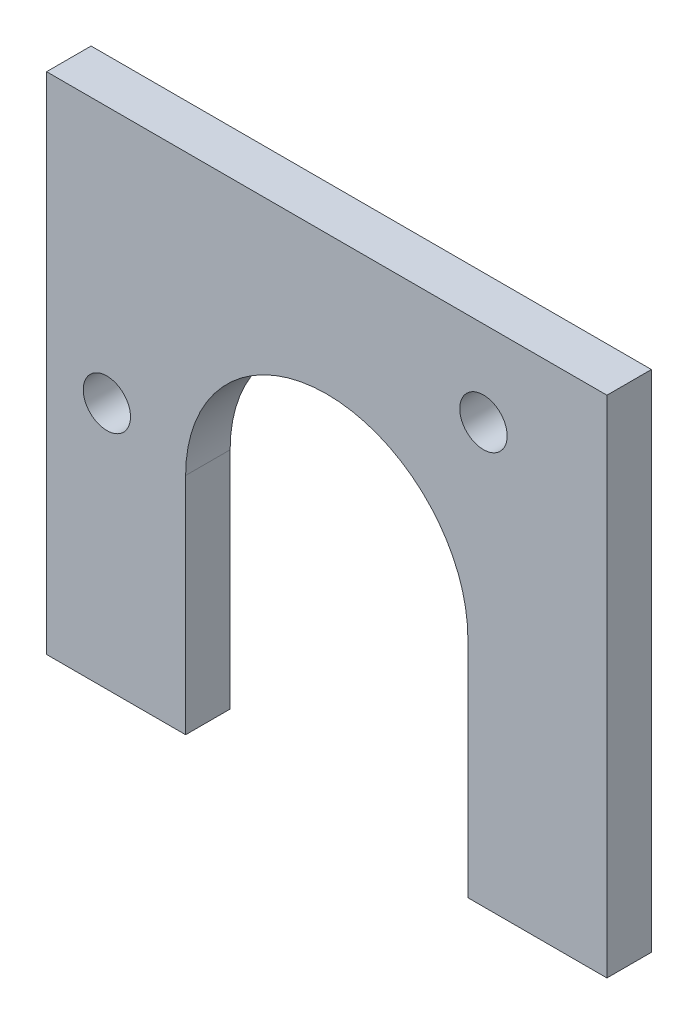
ISO-10303-21;
HEADER;
FILE_DESCRIPTION(('STEP AP214'),'2;1');
FILE_NAME('part.step','',(''),(''),'','','');
FILE_SCHEMA(('AUTOMOTIVE_DESIGN { 1 0 10303 214 1 1 1 1 }'));
ENDSEC;
DATA;
#1=APPLICATION_CONTEXT('core data for automotive mechanical design processes');
#2=APPLICATION_PROTOCOL_DEFINITION('international standard','automotive_design',2000,#1);
#3=PRODUCT_CONTEXT('',#1,'mechanical');
#4=PRODUCT('Part','Part','',(#3));
#5=PRODUCT_RELATED_PRODUCT_CATEGORY('part','',(#4));
#6=PRODUCT_DEFINITION_FORMATION('','',#4);
#7=PRODUCT_DEFINITION_CONTEXT('part definition',#1,'design');
#8=PRODUCT_DEFINITION('design','',#6,#7);
#9=PRODUCT_DEFINITION_SHAPE('','',#8);
#10=(LENGTH_UNIT() NAMED_UNIT(*) SI_UNIT(.MILLI.,.METRE.));
#11=(NAMED_UNIT(*) PLANE_ANGLE_UNIT() SI_UNIT($,.RADIAN.));
#12=(NAMED_UNIT(*) SI_UNIT($,.STERADIAN.) SOLID_ANGLE_UNIT());
#13=UNCERTAINTY_MEASURE_WITH_UNIT(LENGTH_MEASURE(1.E-05),#10,'distance_accuracy_value','');
#14=(GEOMETRIC_REPRESENTATION_CONTEXT(3) GLOBAL_UNCERTAINTY_ASSIGNED_CONTEXT((#13)) GLOBAL_UNIT_ASSIGNED_CONTEXT((#10,
#11,#12)) REPRESENTATION_CONTEXT('',''));
#15=CARTESIAN_POINT('',(0.,0.,0.));
#16=DIRECTION('',(0.,0.,1.));
#17=DIRECTION('',(1.,0.,0.));
#18=AXIS2_PLACEMENT_3D('',#15,#16,#17);
#19=CARTESIAN_POINT('',(10.075,5.,1.6));
#20=DIRECTION('',(1.,0.,0.));
#21=DIRECTION('',(0.,1.,0.));
#22=AXIS2_PLACEMENT_3D('',#19,#20,#21);
#23=PLANE('',#22);
#24=DIRECTION('',(0.,-1.,0.));
#25=VECTOR('',#24,1.);
#26=CARTESIAN_POINT('',(10.075,5.,0.));
#27=LINE('',#26,#25);
#28=CARTESIAN_POINT('',(10.075,5.,0.));
#29=VERTEX_POINT('',#28);
#30=CARTESIAN_POINT('',(10.075,-13.15,0.));
#31=VERTEX_POINT('',#30);
#32=EDGE_CURVE('E134',#29,#31,#27,.T.);
#33=ORIENTED_EDGE('',*,*,#32,.F.);
#34=DIRECTION('',(0.,0.,-1.));
#35=VECTOR('',#34,1.);
#36=CARTESIAN_POINT('',(10.075,5.,1.6));
#37=LINE('',#36,#35);
#38=CARTESIAN_POINT('',(10.075,5.,1.6));
#39=VERTEX_POINT('',#38);
#40=EDGE_CURVE('E11',#39,#29,#37,.T.);
#41=ORIENTED_EDGE('',*,*,#40,.F.);
#42=DIRECTION('',(0.,-1.,0.));
#43=VECTOR('',#42,1.);
#44=CARTESIAN_POINT('',(10.075,5.,1.6));
#45=LINE('',#44,#43);
#46=CARTESIAN_POINT('',(10.075,-13.15,1.6));
#47=VERTEX_POINT('',#46);
#48=EDGE_CURVE('E152',#39,#47,#45,.T.);
#49=ORIENTED_EDGE('',*,*,#48,.T.);
#50=DIRECTION('',(0.,0.,-1.));
#51=VECTOR('',#50,1.);
#52=CARTESIAN_POINT('',(10.075,-13.15,1.6));
#53=LINE('',#52,#51);
#54=EDGE_CURVE('E89',#47,#31,#53,.T.);
#55=ORIENTED_EDGE('',*,*,#54,.T.);
#56=EDGE_LOOP('',(#33,#41,#49,#55));
#57=FACE_BOUND('',#56,.T.);
#58=ADVANCED_FACE('F35',(#57),#23,.T.);
#59=CARTESIAN_POINT('',(10.075,5.,1.6));
#60=DIRECTION('',(0.,-1.,0.));
#61=DIRECTION('',(0.,0.,-1.));
#62=AXIS2_PLACEMENT_3D('',#59,#60,#61);
#63=PLANE('',#62);
#64=DIRECTION('',(-1.,0.,0.));
#65=VECTOR('',#64,1.);
#66=CARTESIAN_POINT('',(10.075,5.,0.));
#67=LINE('',#66,#65);
#68=CARTESIAN_POINT('',(-10.075,5.,0.));
#69=VERTEX_POINT('',#68);
#70=EDGE_CURVE('E80',#29,#69,#67,.T.);
#71=ORIENTED_EDGE('',*,*,#70,.T.);
#72=DIRECTION('',(0.,0.,-1.));
#73=VECTOR('',#72,1.);
#74=CARTESIAN_POINT('',(-10.075,5.,1.6));
#75=LINE('',#74,#73);
#76=CARTESIAN_POINT('',(-10.075,5.,1.6));
#77=VERTEX_POINT('',#76);
#78=EDGE_CURVE('E44',#77,#69,#75,.T.);
#79=ORIENTED_EDGE('',*,*,#78,.F.);
#80=DIRECTION('',(-1.,0.,0.));
#81=VECTOR('',#80,1.);
#82=CARTESIAN_POINT('',(10.075,5.,1.6));
#83=LINE('',#82,#81);
#84=EDGE_CURVE('E112',#39,#77,#83,.T.);
#85=ORIENTED_EDGE('',*,*,#84,.F.);
#86=ORIENTED_EDGE('',*,*,#40,.T.);
#87=EDGE_LOOP('',(#71,#79,#85,#86));
#88=FACE_BOUND('',#87,.T.);
#89=ADVANCED_FACE('F205',(#88),#63,.F.);
#90=CARTESIAN_POINT('',(-10.075,5.,1.6));
#91=DIRECTION('',(1.,0.,0.));
#92=DIRECTION('',(0.,1.,0.));
#93=AXIS2_PLACEMENT_3D('',#90,#91,#92);
#94=PLANE('',#93);
#95=DIRECTION('',(0.,-1.,0.));
#96=VECTOR('',#95,1.);
#97=CARTESIAN_POINT('',(-10.075,5.,0.));
#98=LINE('',#97,#96);
#99=CARTESIAN_POINT('',(-10.075,-13.15,0.));
#100=VERTEX_POINT('',#99);
#101=EDGE_CURVE('E119',#69,#100,#98,.T.);
#102=ORIENTED_EDGE('',*,*,#101,.T.);
#103=DIRECTION('',(0.,0.,-1.));
#104=VECTOR('',#103,1.);
#105=CARTESIAN_POINT('',(-10.075,-13.15,1.6));
#106=LINE('',#105,#104);
#107=CARTESIAN_POINT('',(-10.075,-13.15,1.6));
#108=VERTEX_POINT('',#107);
#109=EDGE_CURVE('E116',#108,#100,#106,.T.);
#110=ORIENTED_EDGE('',*,*,#109,.F.);
#111=DIRECTION('',(0.,-1.,0.));
#112=VECTOR('',#111,1.);
#113=CARTESIAN_POINT('',(-10.075,5.,1.6));
#114=LINE('',#113,#112);
#115=EDGE_CURVE('E105',#77,#108,#114,.T.);
#116=ORIENTED_EDGE('',*,*,#115,.F.);
#117=ORIENTED_EDGE('',*,*,#78,.T.);
#118=EDGE_LOOP('',(#102,#110,#116,#117));
#119=FACE_BOUND('',#118,.T.);
#120=ADVANCED_FACE('F117',(#119),#94,.F.);
#121=CARTESIAN_POINT('',(-10.075,-13.15,1.6));
#122=DIRECTION('',(0.,1.,0.));
#123=DIRECTION('',(0.,0.,1.));
#124=AXIS2_PLACEMENT_3D('',#121,#122,#123);
#125=PLANE('',#124);
#126=DIRECTION('',(1.,0.,0.));
#127=VECTOR('',#126,1.);
#128=CARTESIAN_POINT('',(-10.075,-13.15,0.));
#129=LINE('',#128,#127);
#130=CARTESIAN_POINT('',(-5.075,-13.15,0.));
#131=VERTEX_POINT('',#130);
#132=EDGE_CURVE('E149',#100,#131,#129,.T.);
#133=ORIENTED_EDGE('',*,*,#132,.T.);
#134=DIRECTION('',(0.,0.,-1.));
#135=VECTOR('',#134,1.);
#136=CARTESIAN_POINT('',(-5.075,-13.15,1.6));
#137=LINE('',#136,#135);
#138=CARTESIAN_POINT('',(-5.075,-13.15,1.6));
#139=VERTEX_POINT('',#138);
#140=EDGE_CURVE('E122',#139,#131,#137,.T.);
#141=ORIENTED_EDGE('',*,*,#140,.F.);
#142=DIRECTION('',(1.,0.,0.));
#143=VECTOR('',#142,1.);
#144=CARTESIAN_POINT('',(-10.075,-13.15,1.6));
#145=LINE('',#144,#143);
#146=EDGE_CURVE('E110',#108,#139,#145,.T.);
#147=ORIENTED_EDGE('',*,*,#146,.F.);
#148=ORIENTED_EDGE('',*,*,#109,.T.);
#149=EDGE_LOOP('',(#133,#141,#147,#148));
#150=FACE_BOUND('',#149,.T.);
#151=ADVANCED_FACE('F124',(#150),#125,.F.);
#152=CARTESIAN_POINT('',(-5.075,-13.15,1.6));
#153=DIRECTION('',(-1.,0.,0.));
#154=DIRECTION('',(0.,0.,1.));
#155=AXIS2_PLACEMENT_3D('',#152,#153,#154);
#156=PLANE('',#155);
#157=DIRECTION('',(0.,1.,0.));
#158=VECTOR('',#157,1.);
#159=CARTESIAN_POINT('',(-5.075,-13.15,0.));
#160=LINE('',#159,#158);
#161=CARTESIAN_POINT('',(-5.075,-5.075,0.));
#162=VERTEX_POINT('',#161);
#163=EDGE_CURVE('E147',#131,#162,#160,.T.);
#164=ORIENTED_EDGE('',*,*,#163,.T.);
#165=DIRECTION('',(0.,0.,-1.));
#166=VECTOR('',#165,1.);
#167=CARTESIAN_POINT('',(-5.075,-5.075,1.6));
#168=LINE('',#167,#166);
#169=CARTESIAN_POINT('',(-5.075,-5.075,1.6));
#170=VERTEX_POINT('',#169);
#171=EDGE_CURVE('E156',#170,#162,#168,.T.);
#172=ORIENTED_EDGE('',*,*,#171,.F.);
#173=DIRECTION('',(0.,1.,0.));
#174=VECTOR('',#173,1.);
#175=CARTESIAN_POINT('',(-5.075,-13.15,1.6));
#176=LINE('',#175,#174);
#177=EDGE_CURVE('E127',#139,#170,#176,.T.);
#178=ORIENTED_EDGE('',*,*,#177,.F.);
#179=ORIENTED_EDGE('',*,*,#140,.T.);
#180=EDGE_LOOP('',(#164,#172,#178,#179));
#181=FACE_BOUND('',#180,.T.);
#182=ADVANCED_FACE('F195',(#181),#156,.F.);
#183=CARTESIAN_POINT('',(0.,-5.075,1.6));
#184=DIRECTION('',(0.,0.,-1.));
#185=DIRECTION('',(-1.,0.,0.));
#186=AXIS2_PLACEMENT_3D('',#183,#184,#185);
#187=CYLINDRICAL_SURFACE('',#186,5.075);
#188=CARTESIAN_POINT('',(0.,-5.075,0.));
#189=DIRECTION('',(0.,0.,-1.));
#190=DIRECTION('',(-1.,0.,0.));
#191=AXIS2_PLACEMENT_3D('',#188,#189,#190);
#192=CIRCLE('',#191,5.075);
#193=CARTESIAN_POINT('',(5.075,-5.075,0.));
#194=VERTEX_POINT('',#193);
#195=EDGE_CURVE('E144',#162,#194,#192,.T.);
#196=ORIENTED_EDGE('',*,*,#195,.T.);
#197=DIRECTION('',(0.,0.,-1.));
#198=VECTOR('',#197,1.);
#199=CARTESIAN_POINT('',(5.075,-5.075,1.6));
#200=LINE('',#199,#198);
#201=CARTESIAN_POINT('',(5.075,-5.075,1.6));
#202=VERTEX_POINT('',#201);
#203=EDGE_CURVE('E159',#202,#194,#200,.T.);
#204=ORIENTED_EDGE('',*,*,#203,.F.);
#205=CARTESIAN_POINT('',(0.,-5.075,1.6));
#206=DIRECTION('',(0.,0.,-1.));
#207=DIRECTION('',(-1.,0.,0.));
#208=AXIS2_PLACEMENT_3D('',#205,#206,#207);
#209=CIRCLE('',#208,5.075);
#210=EDGE_CURVE('E129',#170,#202,#209,.T.);
#211=ORIENTED_EDGE('',*,*,#210,.F.);
#212=ORIENTED_EDGE('',*,*,#171,.T.);
#213=EDGE_LOOP('',(#196,#204,#211,#212));
#214=FACE_BOUND('',#213,.T.);
#215=ADVANCED_FACE('F185',(#214),#187,.F.);
#216=CARTESIAN_POINT('',(5.075,-13.15,1.6));
#217=DIRECTION('',(-1.,0.,0.));
#218=DIRECTION('',(0.,0.,1.));
#219=AXIS2_PLACEMENT_3D('',#216,#217,#218);
#220=PLANE('',#219);
#221=DIRECTION('',(0.,1.,0.));
#222=VECTOR('',#221,1.);
#223=CARTESIAN_POINT('',(5.075,-13.15,0.));
#224=LINE('',#223,#222);
#225=CARTESIAN_POINT('',(5.075,-13.15,0.));
#226=VERTEX_POINT('',#225);
#227=EDGE_CURVE('E141',#226,#194,#224,.T.);
#228=ORIENTED_EDGE('',*,*,#227,.F.);
#229=DIRECTION('',(0.,0.,-1.));
#230=VECTOR('',#229,1.);
#231=CARTESIAN_POINT('',(5.075,-13.15,1.6));
#232=LINE('',#231,#230);
#233=CARTESIAN_POINT('',(5.075,-13.15,1.6));
#234=VERTEX_POINT('',#233);
#235=EDGE_CURVE('E161',#234,#226,#232,.T.);
#236=ORIENTED_EDGE('',*,*,#235,.F.);
#237=DIRECTION('',(0.,1.,0.));
#238=VECTOR('',#237,1.);
#239=CARTESIAN_POINT('',(5.075,-13.15,1.6));
#240=LINE('',#239,#238);
#241=EDGE_CURVE('E178',#234,#202,#240,.T.);
#242=ORIENTED_EDGE('',*,*,#241,.T.);
#243=ORIENTED_EDGE('',*,*,#203,.T.);
#244=EDGE_LOOP('',(#228,#236,#242,#243));
#245=FACE_BOUND('',#244,.T.);
#246=ADVANCED_FACE('F189',(#245),#220,.T.);
#247=CARTESIAN_POINT('',(10.075,-13.15,1.6));
#248=DIRECTION('',(0.,-1.,0.));
#249=DIRECTION('',(0.,0.,-1.));
#250=AXIS2_PLACEMENT_3D('',#247,#248,#249);
#251=PLANE('',#250);
#252=DIRECTION('',(-1.,0.,0.));
#253=VECTOR('',#252,1.);
#254=CARTESIAN_POINT('',(10.075,-13.15,0.));
#255=LINE('',#254,#253);
#256=EDGE_CURVE('E137',#31,#226,#255,.T.);
#257=ORIENTED_EDGE('',*,*,#256,.F.);
#258=ORIENTED_EDGE('',*,*,#54,.F.);
#259=DIRECTION('',(-1.,0.,0.));
#260=VECTOR('',#259,1.);
#261=CARTESIAN_POINT('',(10.075,-13.15,1.6));
#262=LINE('',#261,#260);
#263=EDGE_CURVE('E176',#47,#234,#262,.T.);
#264=ORIENTED_EDGE('',*,*,#263,.T.);
#265=ORIENTED_EDGE('',*,*,#235,.T.);
#266=EDGE_LOOP('',(#257,#258,#264,#265));
#267=FACE_BOUND('',#266,.T.);
#268=ADVANCED_FACE('F190',(#267),#251,.T.);
#269=CARTESIAN_POINT('',(0.,-5.075,1.6));
#270=DIRECTION('',(0.,0.,-1.));
#271=DIRECTION('',(-1.,0.,0.));
#272=AXIS2_PLACEMENT_3D('',#269,#270,#271);
#273=PLANE('',#272);
#274=CARTESIAN_POINT('',(-7.9078280078008,-4.2423940563445,1.6));
#275=DIRECTION('',(0.,0.,1.));
#276=DIRECTION('',(1.,0.,0.));
#277=AXIS2_PLACEMENT_3D('',#274,#275,#276);
#278=CIRCLE('',#277,0.85);
#279=CARTESIAN_POINT('',(-7.0578280078008,-4.2423940563445,1.6));
#280=VERTEX_POINT('',#279);
#281=EDGE_CURVE('E172',#280,#280,#278,.T.);
#282=ORIENTED_EDGE('',*,*,#281,.F.);
#283=EDGE_LOOP('',(#282));
#284=FACE_BOUND('',#283,.T.);
#285=CARTESIAN_POINT('',(5.63433839369825,1.93641945545058,1.6));
#286=DIRECTION('',(0.,0.,1.));
#287=DIRECTION('',(1.,0.,0.));
#288=AXIS2_PLACEMENT_3D('',#285,#286,#287);
#289=CIRCLE('',#288,0.852453888533602);
#290=CARTESIAN_POINT('',(6.48679228223185,1.93641945545058,1.6));
#291=VERTEX_POINT('',#290);
#292=EDGE_CURVE('E164',#291,#291,#289,.T.);
#293=ORIENTED_EDGE('',*,*,#292,.F.);
#294=EDGE_LOOP('',(#293));
#295=FACE_BOUND('',#294,.T.);
#296=ORIENTED_EDGE('',*,*,#48,.F.);
#297=ORIENTED_EDGE('',*,*,#84,.T.);
#298=ORIENTED_EDGE('',*,*,#115,.T.);
#299=ORIENTED_EDGE('',*,*,#146,.T.);
#300=ORIENTED_EDGE('',*,*,#177,.T.);
#301=ORIENTED_EDGE('',*,*,#210,.T.);
#302=ORIENTED_EDGE('',*,*,#241,.F.);
#303=ORIENTED_EDGE('',*,*,#263,.F.);
#304=EDGE_LOOP('',(#296,#297,#298,#299,#300,#301,#302,#303));
#305=FACE_BOUND('',#304,.T.);
#306=ADVANCED_FACE('F108',(#284,#295,#305),#273,.F.);
#307=CARTESIAN_POINT('',(0.,-5.075,0.));
#308=DIRECTION('',(0.,0.,-1.));
#309=DIRECTION('',(-1.,0.,0.));
#310=AXIS2_PLACEMENT_3D('',#307,#308,#309);
#311=PLANE('',#310);
#312=CARTESIAN_POINT('',(-7.9078280078008,-4.2423940563445,0.));
#313=DIRECTION('',(0.,0.,-1.));
#314=DIRECTION('',(-1.,0.,0.));
#315=AXIS2_PLACEMENT_3D('',#312,#313,#314);
#316=CIRCLE('',#315,0.85);
#317=CARTESIAN_POINT('',(-8.7578280078008,-4.2423940563445,0.));
#318=VERTEX_POINT('',#317);
#319=EDGE_CURVE('E38',#318,#318,#316,.T.);
#320=ORIENTED_EDGE('',*,*,#319,.F.);
#321=EDGE_LOOP('',(#320));
#322=FACE_BOUND('',#321,.T.);
#323=CARTESIAN_POINT('',(5.63433839369825,1.93641945545058,0.));
#324=DIRECTION('',(0.,0.,-1.));
#325=DIRECTION('',(-1.,0.,0.));
#326=AXIS2_PLACEMENT_3D('',#323,#324,#325);
#327=CIRCLE('',#326,0.852453888533602);
#328=CARTESIAN_POINT('',(4.78188450516465,1.93641945545058,0.));
#329=VERTEX_POINT('',#328);
#330=EDGE_CURVE('E138',#329,#329,#327,.T.);
#331=ORIENTED_EDGE('',*,*,#330,.F.);
#332=EDGE_LOOP('',(#331));
#333=FACE_BOUND('',#332,.T.);
#334=ORIENTED_EDGE('',*,*,#32,.T.);
#335=ORIENTED_EDGE('',*,*,#256,.T.);
#336=ORIENTED_EDGE('',*,*,#227,.T.);
#337=ORIENTED_EDGE('',*,*,#195,.F.);
#338=ORIENTED_EDGE('',*,*,#163,.F.);
#339=ORIENTED_EDGE('',*,*,#132,.F.);
#340=ORIENTED_EDGE('',*,*,#101,.F.);
#341=ORIENTED_EDGE('',*,*,#70,.F.);
#342=EDGE_LOOP('',(#334,#335,#336,#337,#338,#339,#340,#341));
#343=FACE_BOUND('',#342,.T.);
#344=ADVANCED_FACE('F192',(#322,#333,#343),#311,.T.);
#345=CARTESIAN_POINT('',(5.63433839369825,1.93641945545058,-1.4));
#346=DIRECTION('',(0.,0.,1.));
#347=DIRECTION('',(1.,0.,0.));
#348=AXIS2_PLACEMENT_3D('',#345,#346,#347);
#349=CYLINDRICAL_SURFACE('',#348,0.852453888533602);
#350=ORIENTED_EDGE('',*,*,#330,.T.);
#351=EDGE_LOOP('',(#350));
#352=FACE_BOUND('',#351,.T.);
#353=ORIENTED_EDGE('',*,*,#292,.T.);
#354=EDGE_LOOP('',(#353));
#355=FACE_BOUND('',#354,.T.);
#356=ADVANCED_FACE('F217',(#352,#355),#349,.F.);
#357=CARTESIAN_POINT('',(-7.9078280078008,-4.2423940563445,-1.4));
#358=DIRECTION('',(0.,0.,1.));
#359=DIRECTION('',(1.,0.,0.));
#360=AXIS2_PLACEMENT_3D('',#357,#358,#359);
#361=CYLINDRICAL_SURFACE('',#360,0.85);
#362=ORIENTED_EDGE('',*,*,#319,.T.);
#363=EDGE_LOOP('',(#362));
#364=FACE_BOUND('',#363,.T.);
#365=ORIENTED_EDGE('',*,*,#281,.T.);
#366=EDGE_LOOP('',(#365));
#367=FACE_BOUND('',#366,.T.);
#368=ADVANCED_FACE('F224',(#364,#367),#361,.F.);
#369=CLOSED_SHELL('',(#58,#89,#120,#151,#182,#215,#246,#268,#306,#344,#356,#368));
#370=MANIFOLD_SOLID_BREP('B2',#369);
#371=ADVANCED_BREP_SHAPE_REPRESENTATION('',(#18,#370),#14);
#372=SHAPE_DEFINITION_REPRESENTATION(#9,#371);
ENDSEC;
END-ISO-10303-21;
